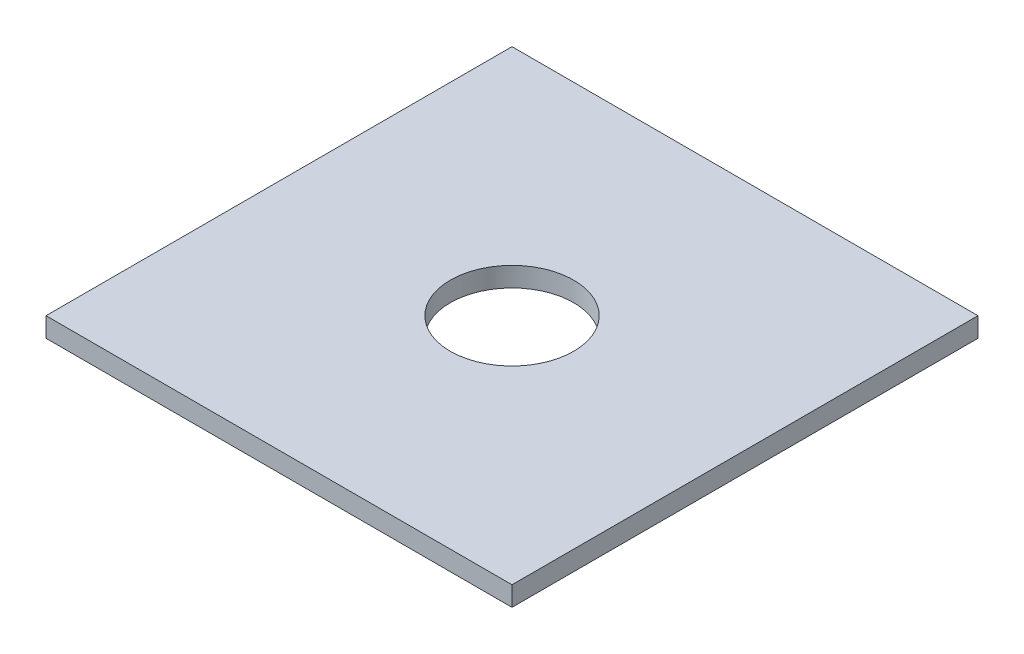
ISO-10303-21;
HEADER;
FILE_DESCRIPTION(('STEP AP214'),'2;1');
FILE_NAME('part.step','',(''),(''),'','','');
FILE_SCHEMA(('AUTOMOTIVE_DESIGN { 1 0 10303 214 1 1 1 1 }'));
ENDSEC;
DATA;
#1=APPLICATION_CONTEXT('core data for automotive mechanical design processes');
#2=APPLICATION_PROTOCOL_DEFINITION('international standard','automotive_design',2000,#1);
#3=PRODUCT_CONTEXT('',#1,'mechanical');
#4=PRODUCT('Part','Part','',(#3));
#5=PRODUCT_RELATED_PRODUCT_CATEGORY('part','',(#4));
#6=PRODUCT_DEFINITION_FORMATION('','',#4);
#7=PRODUCT_DEFINITION_CONTEXT('part definition',#1,'design');
#8=PRODUCT_DEFINITION('design','',#6,#7);
#9=PRODUCT_DEFINITION_SHAPE('','',#8);
#10=(LENGTH_UNIT() NAMED_UNIT(*) SI_UNIT(.MILLI.,.METRE.));
#11=(NAMED_UNIT(*) PLANE_ANGLE_UNIT() SI_UNIT($,.RADIAN.));
#12=(NAMED_UNIT(*) SI_UNIT($,.STERADIAN.) SOLID_ANGLE_UNIT());
#13=UNCERTAINTY_MEASURE_WITH_UNIT(LENGTH_MEASURE(1.E-05),#10,'distance_accuracy_value','');
#14=(GEOMETRIC_REPRESENTATION_CONTEXT(3) GLOBAL_UNCERTAINTY_ASSIGNED_CONTEXT((#13)) GLOBAL_UNIT_ASSIGNED_CONTEXT((#10,
#11,#12)) REPRESENTATION_CONTEXT('',''));
#15=CARTESIAN_POINT('',(0.,0.,0.));
#16=DIRECTION('',(0.,0.,1.));
#17=DIRECTION('',(1.,0.,0.));
#18=AXIS2_PLACEMENT_3D('',#15,#16,#17);
#19=CARTESIAN_POINT('',(0.,10.,0.));
#20=DIRECTION('',(0.,-1.,0.));
#21=DIRECTION('',(0.,0.,-1.));
#22=AXIS2_PLACEMENT_3D('',#19,#20,#21);
#23=PLANE('',#22);
#24=DIRECTION('',(0.,0.,-1.));
#25=VECTOR('',#24,1.);
#26=CARTESIAN_POINT('',(119.,10.,119.));
#27=LINE('',#26,#25);
#28=CARTESIAN_POINT('',(119.,10.,119.));
#29=VERTEX_POINT('',#28);
#30=CARTESIAN_POINT('',(119.,10.,-119.));
#31=VERTEX_POINT('',#30);
#32=EDGE_CURVE('E92',#29,#31,#27,.T.);
#33=ORIENTED_EDGE('',*,*,#32,.T.);
#34=DIRECTION('',(-1.,0.,0.));
#35=VECTOR('',#34,1.);
#36=CARTESIAN_POINT('',(-119.,10.,-119.));
#37=LINE('',#36,#35);
#38=CARTESIAN_POINT('',(-119.,10.,-119.));
#39=VERTEX_POINT('',#38);
#40=EDGE_CURVE('E87',#31,#39,#37,.T.);
#41=ORIENTED_EDGE('',*,*,#40,.T.);
#42=DIRECTION('',(0.,0.,1.));
#43=VECTOR('',#42,1.);
#44=CARTESIAN_POINT('',(-119.,10.,119.));
#45=LINE('',#44,#43);
#46=CARTESIAN_POINT('',(-119.,10.,119.));
#47=VERTEX_POINT('',#46);
#48=EDGE_CURVE('E90',#39,#47,#45,.T.);
#49=ORIENTED_EDGE('',*,*,#48,.T.);
#50=DIRECTION('',(1.,0.,0.));
#51=VECTOR('',#50,1.);
#52=CARTESIAN_POINT('',(-119.,10.,119.));
#53=LINE('',#52,#51);
#54=EDGE_CURVE('E57',#47,#29,#53,.T.);
#55=ORIENTED_EDGE('',*,*,#54,.T.);
#56=EDGE_LOOP('',(#33,#41,#49,#55));
#57=FACE_BOUND('',#56,.T.);
#58=CARTESIAN_POINT('',(0.,10.,0.));
#59=DIRECTION('',(0.,1.,0.));
#60=DIRECTION('',(0.,0.,1.));
#61=AXIS2_PLACEMENT_3D('',#58,#59,#60);
#62=CIRCLE('',#61,31.5);
#63=CARTESIAN_POINT('',(0.,10.,31.5));
#64=VERTEX_POINT('',#63);
#65=EDGE_CURVE('E112',#64,#64,#62,.T.);
#66=ORIENTED_EDGE('',*,*,#65,.F.);
#67=EDGE_LOOP('',(#66));
#68=FACE_BOUND('',#67,.T.);
#69=ADVANCED_FACE('F39',(#57,#68),#23,.F.);
#70=CARTESIAN_POINT('',(0.,0.,0.));
#71=DIRECTION('',(0.,-1.,0.));
#72=DIRECTION('',(0.,0.,-1.));
#73=AXIS2_PLACEMENT_3D('',#70,#71,#72);
#74=PLANE('',#73);
#75=DIRECTION('',(0.,0.,-1.));
#76=VECTOR('',#75,1.);
#77=CARTESIAN_POINT('',(119.,0.,119.));
#78=LINE('',#77,#76);
#79=CARTESIAN_POINT('',(119.,0.,119.));
#80=VERTEX_POINT('',#79);
#81=CARTESIAN_POINT('',(119.,0.,-119.));
#82=VERTEX_POINT('',#81);
#83=EDGE_CURVE('E108',#80,#82,#78,.T.);
#84=ORIENTED_EDGE('',*,*,#83,.F.);
#85=DIRECTION('',(1.,0.,0.));
#86=VECTOR('',#85,1.);
#87=CARTESIAN_POINT('',(-119.,0.,119.));
#88=LINE('',#87,#86);
#89=CARTESIAN_POINT('',(-119.,0.,119.));
#90=VERTEX_POINT('',#89);
#91=EDGE_CURVE('E80',#90,#80,#88,.T.);
#92=ORIENTED_EDGE('',*,*,#91,.F.);
#93=DIRECTION('',(0.,0.,1.));
#94=VECTOR('',#93,1.);
#95=CARTESIAN_POINT('',(-119.,0.,119.));
#96=LINE('',#95,#94);
#97=CARTESIAN_POINT('',(-119.,0.,-119.));
#98=VERTEX_POINT('',#97);
#99=EDGE_CURVE('E74',#98,#90,#96,.T.);
#100=ORIENTED_EDGE('',*,*,#99,.F.);
#101=DIRECTION('',(-1.,0.,0.));
#102=VECTOR('',#101,1.);
#103=CARTESIAN_POINT('',(-119.,0.,-119.));
#104=LINE('',#103,#102);
#105=EDGE_CURVE('E97',#82,#98,#104,.T.);
#106=ORIENTED_EDGE('',*,*,#105,.F.);
#107=EDGE_LOOP('',(#84,#92,#100,#106));
#108=FACE_BOUND('',#107,.T.);
#109=CARTESIAN_POINT('',(0.,0.,0.));
#110=DIRECTION('',(0.,1.,0.));
#111=DIRECTION('',(0.,0.,1.));
#112=AXIS2_PLACEMENT_3D('',#109,#110,#111);
#113=CIRCLE('',#112,31.5);
#114=CARTESIAN_POINT('',(0.,0.,31.5));
#115=VERTEX_POINT('',#114);
#116=EDGE_CURVE('E130',#115,#115,#113,.T.);
#117=ORIENTED_EDGE('',*,*,#116,.T.);
#118=EDGE_LOOP('',(#117));
#119=FACE_BOUND('',#118,.T.);
#120=ADVANCED_FACE('F125',(#108,#119),#74,.T.);
#121=CARTESIAN_POINT('',(119.,10.,119.));
#122=DIRECTION('',(-1.,0.,0.));
#123=DIRECTION('',(0.,0.,1.));
#124=AXIS2_PLACEMENT_3D('',#121,#122,#123);
#125=PLANE('',#124);
#126=ORIENTED_EDGE('',*,*,#83,.T.);
#127=DIRECTION('',(0.,-1.,0.));
#128=VECTOR('',#127,1.);
#129=CARTESIAN_POINT('',(119.,10.,-119.));
#130=LINE('',#129,#128);
#131=EDGE_CURVE('E11',#31,#82,#130,.T.);
#132=ORIENTED_EDGE('',*,*,#131,.F.);
#133=ORIENTED_EDGE('',*,*,#32,.F.);
#134=DIRECTION('',(0.,-1.,0.));
#135=VECTOR('',#134,1.);
#136=CARTESIAN_POINT('',(119.,10.,119.));
#137=LINE('',#136,#135);
#138=EDGE_CURVE('E104',#29,#80,#137,.T.);
#139=ORIENTED_EDGE('',*,*,#138,.T.);
#140=EDGE_LOOP('',(#126,#132,#133,#139));
#141=FACE_BOUND('',#140,.T.);
#142=ADVANCED_FACE('F41',(#141),#125,.F.);
#143=CARTESIAN_POINT('',(-119.,10.,-119.));
#144=DIRECTION('',(0.,0.,1.));
#145=DIRECTION('',(1.,0.,0.));
#146=AXIS2_PLACEMENT_3D('',#143,#144,#145);
#147=PLANE('',#146);
#148=ORIENTED_EDGE('',*,*,#105,.T.);
#149=DIRECTION('',(0.,-1.,0.));
#150=VECTOR('',#149,1.);
#151=CARTESIAN_POINT('',(-119.,10.,-119.));
#152=LINE('',#151,#150);
#153=EDGE_CURVE('E49',#39,#98,#152,.T.);
#154=ORIENTED_EDGE('',*,*,#153,.F.);
#155=ORIENTED_EDGE('',*,*,#40,.F.);
#156=ORIENTED_EDGE('',*,*,#131,.T.);
#157=EDGE_LOOP('',(#148,#154,#155,#156));
#158=FACE_BOUND('',#157,.T.);
#159=ADVANCED_FACE('F96',(#158),#147,.F.);
#160=CARTESIAN_POINT('',(-119.,10.,119.));
#161=DIRECTION('',(1.,0.,0.));
#162=DIRECTION('',(0.,0.,-1.));
#163=AXIS2_PLACEMENT_3D('',#160,#161,#162);
#164=PLANE('',#163);
#165=ORIENTED_EDGE('',*,*,#99,.T.);
#166=DIRECTION('',(0.,-1.,0.));
#167=VECTOR('',#166,1.);
#168=CARTESIAN_POINT('',(-119.,10.,119.));
#169=LINE('',#168,#167);
#170=EDGE_CURVE('E99',#47,#90,#169,.T.);
#171=ORIENTED_EDGE('',*,*,#170,.F.);
#172=ORIENTED_EDGE('',*,*,#48,.F.);
#173=ORIENTED_EDGE('',*,*,#153,.T.);
#174=EDGE_LOOP('',(#165,#171,#172,#173));
#175=FACE_BOUND('',#174,.T.);
#176=ADVANCED_FACE('F100',(#175),#164,.F.);
#177=CARTESIAN_POINT('',(-119.,10.,119.));
#178=DIRECTION('',(0.,0.,-1.));
#179=DIRECTION('',(-1.,0.,0.));
#180=AXIS2_PLACEMENT_3D('',#177,#178,#179);
#181=PLANE('',#180);
#182=ORIENTED_EDGE('',*,*,#91,.T.);
#183=ORIENTED_EDGE('',*,*,#138,.F.);
#184=ORIENTED_EDGE('',*,*,#54,.F.);
#185=ORIENTED_EDGE('',*,*,#170,.T.);
#186=EDGE_LOOP('',(#182,#183,#184,#185));
#187=FACE_BOUND('',#186,.T.);
#188=ADVANCED_FACE('F122',(#187),#181,.F.);
#189=CARTESIAN_POINT('',(0.,10.,0.));
#190=DIRECTION('',(0.,-1.,0.));
#191=DIRECTION('',(0.,0.,-1.));
#192=AXIS2_PLACEMENT_3D('',#189,#190,#191);
#193=CYLINDRICAL_SURFACE('',#192,31.5);
#194=ORIENTED_EDGE('',*,*,#65,.T.);
#195=EDGE_LOOP('',(#194));
#196=FACE_BOUND('',#195,.T.);
#197=ORIENTED_EDGE('',*,*,#116,.F.);
#198=EDGE_LOOP('',(#197));
#199=FACE_BOUND('',#198,.T.);
#200=ADVANCED_FACE('F138',(#196,#199),#193,.F.);
#201=CLOSED_SHELL('',(#69,#120,#142,#159,#176,#188,#200));
#202=MANIFOLD_SOLID_BREP('B2',#201);
#203=ADVANCED_BREP_SHAPE_REPRESENTATION('',(#18,#202),#14);
#204=SHAPE_DEFINITION_REPRESENTATION(#9,#203);
ENDSEC;
END-ISO-10303-21;
